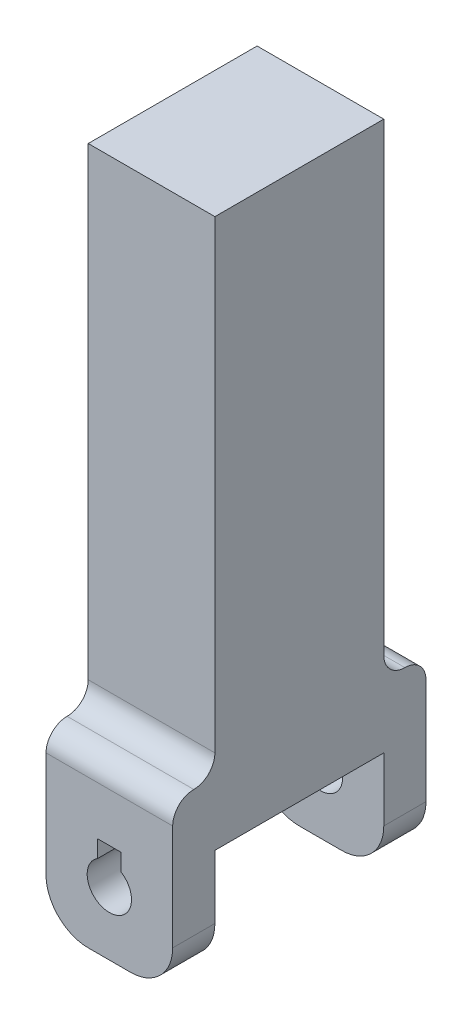
ISO-10303-21;
HEADER;
FILE_DESCRIPTION(('STEP AP214'),'2;1');
FILE_NAME('part.step','',(''),(''),'','','');
FILE_SCHEMA(('AUTOMOTIVE_DESIGN { 1 0 10303 214 1 1 1 1 }'));
ENDSEC;
DATA;
#1=APPLICATION_CONTEXT('core data for automotive mechanical design processes');
#2=APPLICATION_PROTOCOL_DEFINITION('international standard','automotive_design',2000,#1);
#3=PRODUCT_CONTEXT('',#1,'mechanical');
#4=PRODUCT('Part','Part','',(#3));
#5=PRODUCT_RELATED_PRODUCT_CATEGORY('part','',(#4));
#6=PRODUCT_DEFINITION_FORMATION('','',#4);
#7=PRODUCT_DEFINITION_CONTEXT('part definition',#1,'design');
#8=PRODUCT_DEFINITION('design','',#6,#7);
#9=PRODUCT_DEFINITION_SHAPE('','',#8);
#10=(LENGTH_UNIT() NAMED_UNIT(*) SI_UNIT(.MILLI.,.METRE.));
#11=(NAMED_UNIT(*) PLANE_ANGLE_UNIT() SI_UNIT($,.RADIAN.));
#12=(NAMED_UNIT(*) SI_UNIT($,.STERADIAN.) SOLID_ANGLE_UNIT());
#13=UNCERTAINTY_MEASURE_WITH_UNIT(LENGTH_MEASURE(1.E-05),#10,'distance_accuracy_value','');
#14=(GEOMETRIC_REPRESENTATION_CONTEXT(3) GLOBAL_UNCERTAINTY_ASSIGNED_CONTEXT((#13)) GLOBAL_UNIT_ASSIGNED_CONTEXT((#10,
#11,#12)) REPRESENTATION_CONTEXT('',''));
#15=CARTESIAN_POINT('',(0.,0.,0.));
#16=DIRECTION('',(0.,0.,1.));
#17=DIRECTION('',(1.,0.,0.));
#18=AXIS2_PLACEMENT_3D('',#15,#16,#17);
#19=CARTESIAN_POINT('',(-15.,140.,50.));
#20=DIRECTION('',(0.,0.,-1.));
#21=DIRECTION('',(-1.,0.,0.));
#22=AXIS2_PLACEMENT_3D('',#19,#20,#21);
#23=PLANE('',#22);
#24=DIRECTION('',(0.,-1.,0.));
#25=VECTOR('',#24,1.);
#26=CARTESIAN_POINT('',(-15.,140.,50.));
#27=LINE('',#26,#25);
#28=CARTESIAN_POINT('',(-15.,140.,50.));
#29=VERTEX_POINT('',#28);
#30=CARTESIAN_POINT('',(-15.,30.,50.));
#31=VERTEX_POINT('',#30);
#32=EDGE_CURVE('E221',#29,#31,#27,.T.);
#33=ORIENTED_EDGE('',*,*,#32,.T.);
#34=DIRECTION('',(-1.,0.,0.));
#35=VECTOR('',#34,1.);
#36=CARTESIAN_POINT('',(15.,30.,50.));
#37=LINE('',#36,#35);
#38=CARTESIAN_POINT('',(15.,30.,50.));
#39=VERTEX_POINT('',#38);
#40=EDGE_CURVE('E432',#31,#39,#37,.F.);
#41=ORIENTED_EDGE('',*,*,#40,.T.);
#42=DIRECTION('',(0.,-1.,0.));
#43=VECTOR('',#42,1.);
#44=CARTESIAN_POINT('',(15.,140.,50.));
#45=LINE('',#44,#43);
#46=CARTESIAN_POINT('',(15.,140.,50.));
#47=VERTEX_POINT('',#46);
#48=EDGE_CURVE('E223',#47,#39,#45,.T.);
#49=ORIENTED_EDGE('',*,*,#48,.F.);
#50=DIRECTION('',(1.,0.,0.));
#51=VECTOR('',#50,1.);
#52=CARTESIAN_POINT('',(-15.,140.,50.));
#53=LINE('',#52,#51);
#54=EDGE_CURVE('E217',#29,#47,#53,.T.);
#55=ORIENTED_EDGE('',*,*,#54,.F.);
#56=EDGE_LOOP('',(#33,#41,#49,#55));
#57=FACE_BOUND('',#56,.T.);
#58=ADVANCED_FACE('F45',(#57),#23,.F.);
#59=CARTESIAN_POINT('',(0.,0.,60.));
#60=DIRECTION('',(0.,0.,-1.));
#61=DIRECTION('',(-1.,0.,0.));
#62=AXIS2_PLACEMENT_3D('',#59,#60,#61);
#63=CYLINDRICAL_SURFACE('',#62,5.25);
#64=CARTESIAN_POINT('',(0.,0.,50.));
#65=DIRECTION('',(0.,0.,1.));
#66=DIRECTION('',(1.,0.,0.));
#67=AXIS2_PLACEMENT_3D('',#64,#65,#66);
#68=CIRCLE('',#67,5.25);
#69=CARTESIAN_POINT('',(-2.75,4.47213595499958,50.));
#70=VERTEX_POINT('',#69);
#71=CARTESIAN_POINT('',(2.75,4.47213595499958,50.));
#72=VERTEX_POINT('',#71);
#73=EDGE_CURVE('E314',#70,#72,#68,.T.);
#74=ORIENTED_EDGE('',*,*,#73,.F.);
#75=DIRECTION('',(0.,0.,-1.));
#76=VECTOR('',#75,1.);
#77=CARTESIAN_POINT('',(-2.75,4.47213595499958,60.));
#78=LINE('',#77,#76);
#79=CARTESIAN_POINT('',(-2.75,4.47213595499958,60.));
#80=VERTEX_POINT('',#79);
#81=EDGE_CURVE('E384',#80,#70,#78,.T.);
#82=ORIENTED_EDGE('',*,*,#81,.F.);
#83=CARTESIAN_POINT('',(0.,0.,60.));
#84=DIRECTION('',(0.,0.,1.));
#85=DIRECTION('',(1.,0.,0.));
#86=AXIS2_PLACEMENT_3D('',#83,#84,#85);
#87=CIRCLE('',#86,5.25);
#88=CARTESIAN_POINT('',(2.75,4.47213595499958,60.));
#89=VERTEX_POINT('',#88);
#90=EDGE_CURVE('E318',#80,#89,#87,.T.);
#91=ORIENTED_EDGE('',*,*,#90,.T.);
#92=DIRECTION('',(0.,0.,-1.));
#93=VECTOR('',#92,1.);
#94=CARTESIAN_POINT('',(2.75,4.47213595499958,60.));
#95=LINE('',#94,#93);
#96=EDGE_CURVE('E369',#89,#72,#95,.T.);
#97=ORIENTED_EDGE('',*,*,#96,.T.);
#98=EDGE_LOOP('',(#74,#82,#91,#97));
#99=FACE_BOUND('',#98,.T.);
#100=ADVANCED_FACE('F585',(#99),#63,.F.);
#101=CARTESIAN_POINT('',(-2.75,0.,60.));
#102=DIRECTION('',(-1.,0.,0.));
#103=DIRECTION('',(0.,0.,1.));
#104=AXIS2_PLACEMENT_3D('',#101,#102,#103);
#105=PLANE('',#104);
#106=ORIENTED_EDGE('',*,*,#81,.T.);
#107=DIRECTION('',(0.,1.,0.));
#108=VECTOR('',#107,1.);
#109=CARTESIAN_POINT('',(-2.75,0.,50.));
#110=LINE('',#109,#108);
#111=CARTESIAN_POINT('',(-2.75,8.5,50.));
#112=VERTEX_POINT('',#111);
#113=EDGE_CURVE('E310',#70,#112,#110,.T.);
#114=ORIENTED_EDGE('',*,*,#113,.T.);
#115=DIRECTION('',(0.,0.,-1.));
#116=VECTOR('',#115,1.);
#117=CARTESIAN_POINT('',(-2.75,8.5,60.));
#118=LINE('',#117,#116);
#119=CARTESIAN_POINT('',(-2.75,8.5,60.));
#120=VERTEX_POINT('',#119);
#121=EDGE_CURVE('E379',#120,#112,#118,.T.);
#122=ORIENTED_EDGE('',*,*,#121,.F.);
#123=DIRECTION('',(0.,1.,0.));
#124=VECTOR('',#123,1.);
#125=CARTESIAN_POINT('',(-2.75,0.,60.));
#126=LINE('',#125,#124);
#127=EDGE_CURVE('E322',#80,#120,#126,.T.);
#128=ORIENTED_EDGE('',*,*,#127,.F.);
#129=EDGE_LOOP('',(#106,#114,#122,#128));
#130=FACE_BOUND('',#129,.T.);
#131=ADVANCED_FACE('F590',(#130),#105,.F.);
#132=CARTESIAN_POINT('',(0.,8.5,60.));
#133=DIRECTION('',(0.,-1.,0.));
#134=DIRECTION('',(0.,0.,-1.));
#135=AXIS2_PLACEMENT_3D('',#132,#133,#134);
#136=PLANE('',#135);
#137=DIRECTION('',(-1.,0.,0.));
#138=VECTOR('',#137,1.);
#139=CARTESIAN_POINT('',(0.,8.5,50.));
#140=LINE('',#139,#138);
#141=CARTESIAN_POINT('',(2.75,8.5,50.));
#142=VERTEX_POINT('',#141);
#143=EDGE_CURVE('E307',#142,#112,#140,.T.);
#144=ORIENTED_EDGE('',*,*,#143,.F.);
#145=DIRECTION('',(0.,0.,-1.));
#146=VECTOR('',#145,1.);
#147=CARTESIAN_POINT('',(2.75,8.5,60.));
#148=LINE('',#147,#146);
#149=CARTESIAN_POINT('',(2.75,8.5,60.));
#150=VERTEX_POINT('',#149);
#151=EDGE_CURVE('E374',#150,#142,#148,.T.);
#152=ORIENTED_EDGE('',*,*,#151,.F.);
#153=DIRECTION('',(-1.,0.,0.));
#154=VECTOR('',#153,1.);
#155=CARTESIAN_POINT('',(0.,8.5,60.));
#156=LINE('',#155,#154);
#157=EDGE_CURVE('E326',#150,#120,#156,.T.);
#158=ORIENTED_EDGE('',*,*,#157,.T.);
#159=ORIENTED_EDGE('',*,*,#121,.T.);
#160=EDGE_LOOP('',(#144,#152,#158,#159));
#161=FACE_BOUND('',#160,.T.);
#162=ADVANCED_FACE('F615',(#161),#136,.T.);
#163=CARTESIAN_POINT('',(2.75,0.,60.));
#164=DIRECTION('',(-1.,0.,0.));
#165=DIRECTION('',(0.,0.,1.));
#166=AXIS2_PLACEMENT_3D('',#163,#164,#165);
#167=PLANE('',#166);
#168=DIRECTION('',(0.,1.,0.));
#169=VECTOR('',#168,1.);
#170=CARTESIAN_POINT('',(2.75,0.,50.));
#171=LINE('',#170,#169);
#172=EDGE_CURVE('E304',#72,#142,#171,.T.);
#173=ORIENTED_EDGE('',*,*,#172,.F.);
#174=ORIENTED_EDGE('',*,*,#96,.F.);
#175=DIRECTION('',(0.,1.,0.));
#176=VECTOR('',#175,1.);
#177=CARTESIAN_POINT('',(2.75,0.,60.));
#178=LINE('',#177,#176);
#179=EDGE_CURVE('E330',#89,#150,#178,.T.);
#180=ORIENTED_EDGE('',*,*,#179,.T.);
#181=ORIENTED_EDGE('',*,*,#151,.T.);
#182=EDGE_LOOP('',(#173,#174,#180,#181));
#183=FACE_BOUND('',#182,.T.);
#184=ADVANCED_FACE('F612',(#183),#167,.T.);
#185=CARTESIAN_POINT('',(0.,-15.,60.));
#186=DIRECTION('',(0.,1.,0.));
#187=DIRECTION('',(0.,0.,1.));
#188=AXIS2_PLACEMENT_3D('',#185,#186,#187);
#189=PLANE('',#188);
#190=DIRECTION('',(0.,0.,-1.));
#191=VECTOR('',#190,1.);
#192=CARTESIAN_POINT('',(-4.99999999999999,-15.,60.));
#193=LINE('',#192,#191);
#194=CARTESIAN_POINT('',(-4.99999999999999,-15.,60.));
#195=VERTEX_POINT('',#194);
#196=CARTESIAN_POINT('',(-4.99999999999999,-15.,50.));
#197=VERTEX_POINT('',#196);
#198=EDGE_CURVE('E394',#195,#197,#193,.T.);
#199=ORIENTED_EDGE('',*,*,#198,.T.);
#200=DIRECTION('',(-1.,0.,0.));
#201=VECTOR('',#200,1.);
#202=CARTESIAN_POINT('',(15.,-15.,50.));
#203=LINE('',#202,#201);
#204=CARTESIAN_POINT('',(5.00000000000001,-15.,50.));
#205=VERTEX_POINT('',#204);
#206=EDGE_CURVE('E272',#205,#197,#203,.T.);
#207=ORIENTED_EDGE('',*,*,#206,.F.);
#208=DIRECTION('',(0.,0.,-1.));
#209=VECTOR('',#208,1.);
#210=CARTESIAN_POINT('',(5.00000000000001,-15.,60.));
#211=LINE('',#210,#209);
#212=CARTESIAN_POINT('',(5.00000000000001,-15.,60.));
#213=VERTEX_POINT('',#212);
#214=EDGE_CURVE('E388',#205,#213,#211,.F.);
#215=ORIENTED_EDGE('',*,*,#214,.T.);
#216=DIRECTION('',(1.,0.,0.));
#217=VECTOR('',#216,1.);
#218=CARTESIAN_POINT('',(0.,-15.,60.));
#219=LINE('',#218,#217);
#220=EDGE_CURVE('E340',#195,#213,#219,.T.);
#221=ORIENTED_EDGE('',*,*,#220,.F.);
#222=EDGE_LOOP('',(#199,#207,#215,#221));
#223=FACE_BOUND('',#222,.T.);
#224=ADVANCED_FACE('F488',(#223),#189,.F.);
#225=CARTESIAN_POINT('',(-4.99999999999999,-5.,60.));
#226=DIRECTION('',(0.,0.,-1.));
#227=DIRECTION('',(-1.,0.,0.));
#228=AXIS2_PLACEMENT_3D('',#225,#226,#227);
#229=CYLINDRICAL_SURFACE('',#228,10.);
#230=CARTESIAN_POINT('',(-4.99999999999999,-5.,50.));
#231=DIRECTION('',(0.,0.,1.));
#232=DIRECTION('',(1.,0.,0.));
#233=AXIS2_PLACEMENT_3D('',#230,#231,#232);
#234=CIRCLE('',#233,10.);
#235=CARTESIAN_POINT('',(-15.,-5.,50.));
#236=VERTEX_POINT('',#235);
#237=EDGE_CURVE('E301',#197,#236,#234,.F.);
#238=ORIENTED_EDGE('',*,*,#237,.F.);
#239=ORIENTED_EDGE('',*,*,#198,.F.);
#240=CARTESIAN_POINT('',(-4.99999999999999,-5.,60.));
#241=DIRECTION('',(0.,0.,1.));
#242=DIRECTION('',(1.,0.,0.));
#243=AXIS2_PLACEMENT_3D('',#240,#241,#242);
#244=CIRCLE('',#243,10.);
#245=CARTESIAN_POINT('',(-15.,-5.,60.));
#246=VERTEX_POINT('',#245);
#247=EDGE_CURVE('E414',#246,#195,#244,.T.);
#248=ORIENTED_EDGE('',*,*,#247,.F.);
#249=DIRECTION('',(0.,0.,-1.));
#250=VECTOR('',#249,1.);
#251=CARTESIAN_POINT('',(-15.,-5.,60.));
#252=LINE('',#251,#250);
#253=EDGE_CURVE('E405',#236,#246,#252,.F.);
#254=ORIENTED_EDGE('',*,*,#253,.F.);
#255=EDGE_LOOP('',(#238,#239,#248,#254));
#256=FACE_BOUND('',#255,.T.);
#257=ADVANCED_FACE('F484',(#256),#229,.T.);
#258=CARTESIAN_POINT('',(5.00000000000001,-5.,60.));
#259=DIRECTION('',(0.,0.,1.));
#260=DIRECTION('',(1.,0.,0.));
#261=AXIS2_PLACEMENT_3D('',#258,#259,#260);
#262=CYLINDRICAL_SURFACE('',#261,10.);
#263=CARTESIAN_POINT('',(5.00000000000001,-5.,50.));
#264=DIRECTION('',(0.,0.,1.));
#265=DIRECTION('',(1.,0.,0.));
#266=AXIS2_PLACEMENT_3D('',#263,#264,#265);
#267=CIRCLE('',#266,10.);
#268=CARTESIAN_POINT('',(15.,-5.,50.));
#269=VERTEX_POINT('',#268);
#270=EDGE_CURVE('E425',#269,#205,#267,.F.);
#271=ORIENTED_EDGE('',*,*,#270,.F.);
#272=DIRECTION('',(0.,0.,-1.));
#273=VECTOR('',#272,1.);
#274=CARTESIAN_POINT('',(15.,-5.,0.));
#275=LINE('',#274,#273);
#276=CARTESIAN_POINT('',(15.,-5.,60.));
#277=VERTEX_POINT('',#276);
#278=EDGE_CURVE('E418',#277,#269,#275,.T.);
#279=ORIENTED_EDGE('',*,*,#278,.F.);
#280=CARTESIAN_POINT('',(5.00000000000001,-5.,60.));
#281=DIRECTION('',(0.,0.,1.));
#282=DIRECTION('',(1.,0.,0.));
#283=AXIS2_PLACEMENT_3D('',#280,#281,#282);
#284=CIRCLE('',#283,10.);
#285=EDGE_CURVE('E410',#213,#277,#284,.T.);
#286=ORIENTED_EDGE('',*,*,#285,.F.);
#287=ORIENTED_EDGE('',*,*,#214,.F.);
#288=EDGE_LOOP('',(#271,#279,#286,#287));
#289=FACE_BOUND('',#288,.T.);
#290=ADVANCED_FACE('F573',(#289),#262,.T.);
#291=CARTESIAN_POINT('',(15.,0.,60.));
#292=DIRECTION('',(1.,0.,0.));
#293=DIRECTION('',(0.,1.,0.));
#294=AXIS2_PLACEMENT_3D('',#291,#292,#293);
#295=PLANE('',#294);
#296=DIRECTION('',(0.,-1.,0.));
#297=VECTOR('',#296,1.);
#298=CARTESIAN_POINT('',(15.,0.,0.));
#299=LINE('',#298,#297);
#300=CARTESIAN_POINT('',(15.,20.,0.));
#301=VERTEX_POINT('',#300);
#302=CARTESIAN_POINT('',(15.,-5.,0.));
#303=VERTEX_POINT('',#302);
#304=EDGE_CURVE('E360',#301,#303,#299,.T.);
#305=ORIENTED_EDGE('',*,*,#304,.F.);
#306=CARTESIAN_POINT('',(15.,20.,5.));
#307=DIRECTION('',(1.,0.,0.));
#308=DIRECTION('',(0.,1.,0.));
#309=AXIS2_PLACEMENT_3D('',#306,#307,#308);
#310=CIRCLE('',#309,5.);
#311=CARTESIAN_POINT('',(15.,25.,5.));
#312=VERTEX_POINT('',#311);
#313=EDGE_CURVE('E446',#301,#312,#310,.T.);
#314=ORIENTED_EDGE('',*,*,#313,.T.);
#315=CARTESIAN_POINT('',(15.,30.,5.));
#316=DIRECTION('',(1.,0.,0.));
#317=DIRECTION('',(0.,1.,0.));
#318=AXIS2_PLACEMENT_3D('',#315,#316,#317);
#319=CIRCLE('',#318,5.);
#320=CARTESIAN_POINT('',(15.,30.,10.));
#321=VERTEX_POINT('',#320);
#322=EDGE_CURVE('E452',#312,#321,#319,.F.);
#323=ORIENTED_EDGE('',*,*,#322,.T.);
#324=DIRECTION('',(0.,-1.,0.));
#325=VECTOR('',#324,1.);
#326=CARTESIAN_POINT('',(15.,140.,10.));
#327=LINE('',#326,#325);
#328=CARTESIAN_POINT('',(15.,140.,10.));
#329=VERTEX_POINT('',#328);
#330=EDGE_CURVE('E249',#329,#321,#327,.T.);
#331=ORIENTED_EDGE('',*,*,#330,.F.);
#332=DIRECTION('',(0.,0.,-1.));
#333=VECTOR('',#332,1.);
#334=CARTESIAN_POINT('',(15.,140.,10.));
#335=LINE('',#334,#333);
#336=EDGE_CURVE('E227',#47,#329,#335,.T.);
#337=ORIENTED_EDGE('',*,*,#336,.F.);
#338=ORIENTED_EDGE('',*,*,#48,.T.);
#339=CARTESIAN_POINT('',(15.,30.,55.));
#340=DIRECTION('',(1.,0.,0.));
#341=DIRECTION('',(0.,1.,0.));
#342=AXIS2_PLACEMENT_3D('',#339,#340,#341);
#343=CIRCLE('',#342,5.);
#344=CARTESIAN_POINT('',(15.,25.,55.));
#345=VERTEX_POINT('',#344);
#346=EDGE_CURVE('E11',#39,#345,#343,.F.);
#347=ORIENTED_EDGE('',*,*,#346,.T.);
#348=CARTESIAN_POINT('',(15.,20.,55.));
#349=DIRECTION('',(1.,0.,0.));
#350=DIRECTION('',(0.,1.,0.));
#351=AXIS2_PLACEMENT_3D('',#348,#349,#350);
#352=CIRCLE('',#351,5.);
#353=CARTESIAN_POINT('',(15.,20.,60.));
#354=VERTEX_POINT('',#353);
#355=EDGE_CURVE('E62',#345,#354,#352,.T.);
#356=ORIENTED_EDGE('',*,*,#355,.T.);
#357=DIRECTION('',(0.,-1.,0.));
#358=VECTOR('',#357,1.);
#359=CARTESIAN_POINT('',(15.,0.,60.));
#360=LINE('',#359,#358);
#361=EDGE_CURVE('E334',#354,#277,#360,.T.);
#362=ORIENTED_EDGE('',*,*,#361,.T.);
#363=ORIENTED_EDGE('',*,*,#278,.T.);
#364=DIRECTION('',(0.,1.,0.));
#365=VECTOR('',#364,1.);
#366=CARTESIAN_POINT('',(15.,10.,50.));
#367=LINE('',#366,#365);
#368=CARTESIAN_POINT('',(15.,10.,50.));
#369=VERTEX_POINT('',#368);
#370=EDGE_CURVE('E253',#269,#369,#367,.T.);
#371=ORIENTED_EDGE('',*,*,#370,.T.);
#372=DIRECTION('',(0.,0.,-1.));
#373=VECTOR('',#372,1.);
#374=CARTESIAN_POINT('',(15.,10.,10.));
#375=LINE('',#374,#373);
#376=CARTESIAN_POINT('',(15.,10.,10.));
#377=VERTEX_POINT('',#376);
#378=EDGE_CURVE('E257',#369,#377,#375,.T.);
#379=ORIENTED_EDGE('',*,*,#378,.T.);
#380=DIRECTION('',(0.,-1.,0.));
#381=VECTOR('',#380,1.);
#382=CARTESIAN_POINT('',(15.,10.,10.));
#383=LINE('',#382,#381);
#384=CARTESIAN_POINT('',(15.,-5.,10.));
#385=VERTEX_POINT('',#384);
#386=EDGE_CURVE('E262',#377,#385,#383,.T.);
#387=ORIENTED_EDGE('',*,*,#386,.T.);
#388=EDGE_CURVE('E417',#385,#303,#275,.T.);
#389=ORIENTED_EDGE('',*,*,#388,.T.);
#390=EDGE_LOOP('',(#305,#314,#323,#331,#337,#338,#347,#356,#362,#363,#371,#379,#387,#389));
#391=FACE_BOUND('',#390,.T.);
#392=ADVANCED_FACE('F545',(#391),#295,.T.);
#393=CARTESIAN_POINT('',(-15.,0.,60.));
#394=DIRECTION('',(1.,0.,0.));
#395=DIRECTION('',(0.,1.,0.));
#396=AXIS2_PLACEMENT_3D('',#393,#394,#395);
#397=PLANE('',#396);
#398=DIRECTION('',(0.,-1.,0.));
#399=VECTOR('',#398,1.);
#400=CARTESIAN_POINT('',(-15.,140.,10.));
#401=LINE('',#400,#399);
#402=CARTESIAN_POINT('',(-15.,140.,10.));
#403=VERTEX_POINT('',#402);
#404=CARTESIAN_POINT('',(-15.,30.,10.));
#405=VERTEX_POINT('',#404);
#406=EDGE_CURVE('E561',#403,#405,#401,.T.);
#407=ORIENTED_EDGE('',*,*,#406,.T.);
#408=CARTESIAN_POINT('',(-15.,30.,5.));
#409=DIRECTION('',(1.,0.,0.));
#410=DIRECTION('',(0.,1.,0.));
#411=AXIS2_PLACEMENT_3D('',#408,#409,#410);
#412=CIRCLE('',#411,5.);
#413=CARTESIAN_POINT('',(-15.,25.,5.));
#414=VERTEX_POINT('',#413);
#415=EDGE_CURVE('E455',#405,#414,#412,.T.);
#416=ORIENTED_EDGE('',*,*,#415,.T.);
#417=CARTESIAN_POINT('',(-15.,20.,5.));
#418=DIRECTION('',(1.,0.,0.));
#419=DIRECTION('',(0.,1.,0.));
#420=AXIS2_PLACEMENT_3D('',#417,#418,#419);
#421=CIRCLE('',#420,5.);
#422=CARTESIAN_POINT('',(-15.,20.,0.));
#423=VERTEX_POINT('',#422);
#424=EDGE_CURVE('E438',#414,#423,#421,.F.);
#425=ORIENTED_EDGE('',*,*,#424,.T.);
#426=DIRECTION('',(0.,-1.,0.));
#427=VECTOR('',#426,1.);
#428=CARTESIAN_POINT('',(-15.,0.,0.));
#429=LINE('',#428,#427);
#430=CARTESIAN_POINT('',(-15.,-5.,0.));
#431=VERTEX_POINT('',#430);
#432=EDGE_CURVE('E363',#423,#431,#429,.T.);
#433=ORIENTED_EDGE('',*,*,#432,.T.);
#434=CARTESIAN_POINT('',(-15.,-5.,10.));
#435=VERTEX_POINT('',#434);
#436=EDGE_CURVE('E406',#431,#435,#252,.F.);
#437=ORIENTED_EDGE('',*,*,#436,.T.);
#438=DIRECTION('',(0.,-1.,0.));
#439=VECTOR('',#438,1.);
#440=CARTESIAN_POINT('',(-15.,10.,10.));
#441=LINE('',#440,#439);
#442=CARTESIAN_POINT('',(-15.,10.,10.));
#443=VERTEX_POINT('',#442);
#444=EDGE_CURVE('E258',#443,#435,#441,.T.);
#445=ORIENTED_EDGE('',*,*,#444,.F.);
#446=DIRECTION('',(0.,0.,-1.));
#447=VECTOR('',#446,1.);
#448=CARTESIAN_POINT('',(-15.,10.,10.));
#449=LINE('',#448,#447);
#450=CARTESIAN_POINT('',(-15.,10.,50.));
#451=VERTEX_POINT('',#450);
#452=EDGE_CURVE('E247',#451,#443,#449,.T.);
#453=ORIENTED_EDGE('',*,*,#452,.F.);
#454=DIRECTION('',(0.,1.,0.));
#455=VECTOR('',#454,1.);
#456=CARTESIAN_POINT('',(-15.,10.,50.));
#457=LINE('',#456,#455);
#458=EDGE_CURVE('E243',#236,#451,#457,.T.);
#459=ORIENTED_EDGE('',*,*,#458,.F.);
#460=ORIENTED_EDGE('',*,*,#253,.T.);
#461=DIRECTION('',(0.,-1.,0.));
#462=VECTOR('',#461,1.);
#463=CARTESIAN_POINT('',(-15.,0.,60.));
#464=LINE('',#463,#462);
#465=CARTESIAN_POINT('',(-15.,20.,60.));
#466=VERTEX_POINT('',#465);
#467=EDGE_CURVE('E337',#466,#246,#464,.T.);
#468=ORIENTED_EDGE('',*,*,#467,.F.);
#469=CARTESIAN_POINT('',(-15.,20.,55.));
#470=DIRECTION('',(1.,0.,0.));
#471=DIRECTION('',(0.,1.,0.));
#472=AXIS2_PLACEMENT_3D('',#469,#470,#471);
#473=CIRCLE('',#472,5.);
#474=CARTESIAN_POINT('',(-15.,25.,55.));
#475=VERTEX_POINT('',#474);
#476=EDGE_CURVE('E435',#466,#475,#473,.F.);
#477=ORIENTED_EDGE('',*,*,#476,.T.);
#478=CARTESIAN_POINT('',(-15.,30.,55.));
#479=DIRECTION('',(1.,0.,0.));
#480=DIRECTION('',(0.,1.,0.));
#481=AXIS2_PLACEMENT_3D('',#478,#479,#480);
#482=CIRCLE('',#481,5.);
#483=EDGE_CURVE('E55',#475,#31,#482,.T.);
#484=ORIENTED_EDGE('',*,*,#483,.T.);
#485=ORIENTED_EDGE('',*,*,#32,.F.);
#486=DIRECTION('',(0.,0.,1.));
#487=VECTOR('',#486,1.);
#488=CARTESIAN_POINT('',(-15.,140.,10.));
#489=LINE('',#488,#487);
#490=EDGE_CURVE('E228',#403,#29,#489,.T.);
#491=ORIENTED_EDGE('',*,*,#490,.F.);
#492=EDGE_LOOP('',(#407,#416,#425,#433,#437,#445,#453,#459,#460,#468,#477,#484,#485,#491));
#493=FACE_BOUND('',#492,.T.);
#494=ADVANCED_FACE('F240',(#493),#397,.F.);
#495=CARTESIAN_POINT('',(0.,0.,10.));
#496=DIRECTION('',(0.,0.,-1.));
#497=DIRECTION('',(0.,1.,0.));
#498=AXIS2_PLACEMENT_3D('',#495,#496,#497);
#499=CIRCLE('',#498,5.25);
#500=CARTESIAN_POINT('',(2.75,4.47213595499958,10.));
#501=VERTEX_POINT('',#500);
#502=CARTESIAN_POINT('',(-2.75,4.47213595499958,10.));
#503=VERTEX_POINT('',#502);
#504=EDGE_CURVE('E298',#501,#503,#499,.T.);
#505=ORIENTED_EDGE('',*,*,#504,.F.);
#506=CARTESIAN_POINT('',(2.75,4.47213595499958,0.));
#507=VERTEX_POINT('',#506);
#508=EDGE_CURVE('E344',#501,#507,#95,.T.);
#509=ORIENTED_EDGE('',*,*,#508,.T.);
#510=CARTESIAN_POINT('',(0.,0.,0.));
#511=DIRECTION('',(0.,0.,1.));
#512=DIRECTION('',(1.,0.,0.));
#513=AXIS2_PLACEMENT_3D('',#510,#511,#512);
#514=CIRCLE('',#513,5.25);
#515=CARTESIAN_POINT('',(-2.75,4.47213595499958,0.));
#516=VERTEX_POINT('',#515);
#517=EDGE_CURVE('E317',#516,#507,#514,.T.);
#518=ORIENTED_EDGE('',*,*,#517,.F.);
#519=EDGE_CURVE('E383',#503,#516,#78,.T.);
#520=ORIENTED_EDGE('',*,*,#519,.F.);
#521=EDGE_LOOP('',(#505,#509,#518,#520));
#522=FACE_BOUND('',#521,.T.);
#523=ADVANCED_FACE('F503',(#522),#63,.F.);
#524=CARTESIAN_POINT('',(-2.75,8.5,10.));
#525=VERTEX_POINT('',#524);
#526=CARTESIAN_POINT('',(-2.75,8.5,0.));
#527=VERTEX_POINT('',#526);
#528=EDGE_CURVE('E378',#525,#527,#118,.T.);
#529=ORIENTED_EDGE('',*,*,#528,.F.);
#530=DIRECTION('',(0.,-1.,0.));
#531=VECTOR('',#530,1.);
#532=CARTESIAN_POINT('',(-2.75,0.,10.));
#533=LINE('',#532,#531);
#534=EDGE_CURVE('E294',#525,#503,#533,.T.);
#535=ORIENTED_EDGE('',*,*,#534,.T.);
#536=ORIENTED_EDGE('',*,*,#519,.T.);
#537=DIRECTION('',(0.,1.,0.));
#538=VECTOR('',#537,1.);
#539=CARTESIAN_POINT('',(-2.75,0.,0.));
#540=LINE('',#539,#538);
#541=EDGE_CURVE('E348',#516,#527,#540,.T.);
#542=ORIENTED_EDGE('',*,*,#541,.T.);
#543=EDGE_LOOP('',(#529,#535,#536,#542));
#544=FACE_BOUND('',#543,.T.);
#545=ADVANCED_FACE('F520',(#544),#105,.F.);
#546=DIRECTION('',(1.,0.,0.));
#547=VECTOR('',#546,1.);
#548=CARTESIAN_POINT('',(0.,8.5,10.));
#549=LINE('',#548,#547);
#550=CARTESIAN_POINT('',(2.75,8.5,10.));
#551=VERTEX_POINT('',#550);
#552=EDGE_CURVE('E291',#525,#551,#549,.T.);
#553=ORIENTED_EDGE('',*,*,#552,.F.);
#554=ORIENTED_EDGE('',*,*,#528,.T.);
#555=DIRECTION('',(-1.,0.,0.));
#556=VECTOR('',#555,1.);
#557=CARTESIAN_POINT('',(0.,8.5,0.));
#558=LINE('',#557,#556);
#559=CARTESIAN_POINT('',(2.75,8.5,0.));
#560=VERTEX_POINT('',#559);
#561=EDGE_CURVE('E352',#560,#527,#558,.T.);
#562=ORIENTED_EDGE('',*,*,#561,.F.);
#563=EDGE_CURVE('E373',#551,#560,#148,.T.);
#564=ORIENTED_EDGE('',*,*,#563,.F.);
#565=EDGE_LOOP('',(#553,#554,#562,#564));
#566=FACE_BOUND('',#565,.T.);
#567=ADVANCED_FACE('F517',(#566),#136,.T.);
#568=DIRECTION('',(0.,-1.,0.));
#569=VECTOR('',#568,1.);
#570=CARTESIAN_POINT('',(2.75,0.,10.));
#571=LINE('',#570,#569);
#572=EDGE_CURVE('E288',#551,#501,#571,.T.);
#573=ORIENTED_EDGE('',*,*,#572,.F.);
#574=ORIENTED_EDGE('',*,*,#563,.T.);
#575=DIRECTION('',(0.,1.,0.));
#576=VECTOR('',#575,1.);
#577=CARTESIAN_POINT('',(2.75,0.,0.));
#578=LINE('',#577,#576);
#579=EDGE_CURVE('E356',#507,#560,#578,.T.);
#580=ORIENTED_EDGE('',*,*,#579,.F.);
#581=ORIENTED_EDGE('',*,*,#508,.F.);
#582=EDGE_LOOP('',(#573,#574,#580,#581));
#583=FACE_BOUND('',#582,.T.);
#584=ADVANCED_FACE('F512',(#583),#167,.T.);
#585=CARTESIAN_POINT('',(5.00000000000001,-15.,0.));
#586=VERTEX_POINT('',#585);
#587=CARTESIAN_POINT('',(5.00000000000001,-15.,10.));
#588=VERTEX_POINT('',#587);
#589=EDGE_CURVE('E389',#586,#588,#211,.F.);
#590=ORIENTED_EDGE('',*,*,#589,.T.);
#591=DIRECTION('',(-1.,0.,0.));
#592=VECTOR('',#591,1.);
#593=CARTESIAN_POINT('',(15.,-15.,10.));
#594=LINE('',#593,#592);
#595=CARTESIAN_POINT('',(-4.99999999999999,-15.,10.));
#596=VERTEX_POINT('',#595);
#597=EDGE_CURVE('E276',#588,#596,#594,.T.);
#598=ORIENTED_EDGE('',*,*,#597,.T.);
#599=CARTESIAN_POINT('',(-4.99999999999999,-15.,0.));
#600=VERTEX_POINT('',#599);
#601=EDGE_CURVE('E393',#596,#600,#193,.T.);
#602=ORIENTED_EDGE('',*,*,#601,.T.);
#603=DIRECTION('',(1.,0.,0.));
#604=VECTOR('',#603,1.);
#605=CARTESIAN_POINT('',(0.,-15.,0.));
#606=LINE('',#605,#604);
#607=EDGE_CURVE('E323',#600,#586,#606,.T.);
#608=ORIENTED_EDGE('',*,*,#607,.T.);
#609=EDGE_LOOP('',(#590,#598,#602,#608));
#610=FACE_BOUND('',#609,.T.);
#611=ADVANCED_FACE('F535',(#610),#189,.F.);
#612=CARTESIAN_POINT('',(0.,0.,60.));
#613=DIRECTION('',(0.,0.,1.));
#614=DIRECTION('',(1.,0.,0.));
#615=AXIS2_PLACEMENT_3D('',#612,#613,#614);
#616=PLANE('',#615);
#617=ORIENTED_EDGE('',*,*,#90,.F.);
#618=ORIENTED_EDGE('',*,*,#127,.T.);
#619=ORIENTED_EDGE('',*,*,#157,.F.);
#620=ORIENTED_EDGE('',*,*,#179,.F.);
#621=EDGE_LOOP('',(#617,#618,#619,#620));
#622=FACE_BOUND('',#621,.T.);
#623=ORIENTED_EDGE('',*,*,#361,.F.);
#624=DIRECTION('',(1.,0.,0.));
#625=VECTOR('',#624,1.);
#626=CARTESIAN_POINT('',(-15.,20.,60.));
#627=LINE('',#626,#625);
#628=EDGE_CURVE('E449',#354,#466,#627,.F.);
#629=ORIENTED_EDGE('',*,*,#628,.T.);
#630=ORIENTED_EDGE('',*,*,#467,.T.);
#631=ORIENTED_EDGE('',*,*,#247,.T.);
#632=ORIENTED_EDGE('',*,*,#220,.T.);
#633=ORIENTED_EDGE('',*,*,#285,.T.);
#634=EDGE_LOOP('',(#623,#629,#630,#631,#632,#633));
#635=FACE_BOUND('',#634,.T.);
#636=ADVANCED_FACE('F474',(#622,#635),#616,.T.);
#637=CARTESIAN_POINT('',(0.,0.,0.));
#638=DIRECTION('',(0.,0.,1.));
#639=DIRECTION('',(1.,0.,0.));
#640=AXIS2_PLACEMENT_3D('',#637,#638,#639);
#641=PLANE('',#640);
#642=ORIENTED_EDGE('',*,*,#517,.T.);
#643=ORIENTED_EDGE('',*,*,#579,.T.);
#644=ORIENTED_EDGE('',*,*,#561,.T.);
#645=ORIENTED_EDGE('',*,*,#541,.F.);
#646=EDGE_LOOP('',(#642,#643,#644,#645));
#647=FACE_BOUND('',#646,.T.);
#648=ORIENTED_EDGE('',*,*,#432,.F.);
#649=DIRECTION('',(-1.,0.,0.));
#650=VECTOR('',#649,1.);
#651=CARTESIAN_POINT('',(15.,20.,0.));
#652=LINE('',#651,#650);
#653=EDGE_CURVE('E441',#423,#301,#652,.F.);
#654=ORIENTED_EDGE('',*,*,#653,.T.);
#655=ORIENTED_EDGE('',*,*,#304,.T.);
#656=CARTESIAN_POINT('',(5.00000000000001,-5.,0.));
#657=DIRECTION('',(0.,0.,1.));
#658=DIRECTION('',(1.,0.,0.));
#659=AXIS2_PLACEMENT_3D('',#656,#657,#658);
#660=CIRCLE('',#659,10.);
#661=EDGE_CURVE('E398',#303,#586,#660,.F.);
#662=ORIENTED_EDGE('',*,*,#661,.T.);
#663=ORIENTED_EDGE('',*,*,#607,.F.);
#664=CARTESIAN_POINT('',(-4.99999999999999,-5.,0.));
#665=DIRECTION('',(0.,0.,1.));
#666=DIRECTION('',(1.,0.,0.));
#667=AXIS2_PLACEMENT_3D('',#664,#665,#666);
#668=CIRCLE('',#667,10.);
#669=EDGE_CURVE('E401',#600,#431,#668,.F.);
#670=ORIENTED_EDGE('',*,*,#669,.T.);
#671=EDGE_LOOP('',(#648,#654,#655,#662,#663,#670));
#672=FACE_BOUND('',#671,.T.);
#673=ADVANCED_FACE('F510',(#647,#672),#641,.F.);
#674=CARTESIAN_POINT('',(-4.99999999999999,-5.,10.));
#675=DIRECTION('',(0.,0.,-1.));
#676=DIRECTION('',(0.,1.,0.));
#677=AXIS2_PLACEMENT_3D('',#674,#675,#676);
#678=CIRCLE('',#677,10.);
#679=EDGE_CURVE('E275',#435,#596,#678,.F.);
#680=ORIENTED_EDGE('',*,*,#679,.F.);
#681=ORIENTED_EDGE('',*,*,#436,.F.);
#682=ORIENTED_EDGE('',*,*,#669,.F.);
#683=ORIENTED_EDGE('',*,*,#601,.F.);
#684=EDGE_LOOP('',(#680,#681,#682,#683));
#685=FACE_BOUND('',#684,.T.);
#686=ADVANCED_FACE('F538',(#685),#229,.T.);
#687=CARTESIAN_POINT('',(5.00000000000001,-5.,10.));
#688=DIRECTION('',(0.,0.,-1.));
#689=DIRECTION('',(0.,1.,0.));
#690=AXIS2_PLACEMENT_3D('',#687,#688,#689);
#691=CIRCLE('',#690,10.);
#692=EDGE_CURVE('E422',#588,#385,#691,.F.);
#693=ORIENTED_EDGE('',*,*,#692,.F.);
#694=ORIENTED_EDGE('',*,*,#589,.F.);
#695=ORIENTED_EDGE('',*,*,#661,.F.);
#696=ORIENTED_EDGE('',*,*,#388,.F.);
#697=EDGE_LOOP('',(#693,#694,#695,#696));
#698=FACE_BOUND('',#697,.T.);
#699=ADVANCED_FACE('F549',(#698),#262,.T.);
#700=CARTESIAN_POINT('',(15.,10.,50.));
#701=DIRECTION('',(0.,0.,1.));
#702=DIRECTION('',(1.,0.,0.));
#703=AXIS2_PLACEMENT_3D('',#700,#701,#702);
#704=PLANE('',#703);
#705=ORIENTED_EDGE('',*,*,#73,.T.);
#706=ORIENTED_EDGE('',*,*,#172,.T.);
#707=ORIENTED_EDGE('',*,*,#143,.T.);
#708=ORIENTED_EDGE('',*,*,#113,.F.);
#709=EDGE_LOOP('',(#705,#706,#707,#708));
#710=FACE_BOUND('',#709,.T.);
#711=ORIENTED_EDGE('',*,*,#237,.T.);
#712=ORIENTED_EDGE('',*,*,#458,.T.);
#713=DIRECTION('',(-1.,0.,0.));
#714=VECTOR('',#713,1.);
#715=CARTESIAN_POINT('',(15.,10.,50.));
#716=LINE('',#715,#714);
#717=EDGE_CURVE('E265',#369,#451,#716,.T.);
#718=ORIENTED_EDGE('',*,*,#717,.F.);
#719=ORIENTED_EDGE('',*,*,#370,.F.);
#720=ORIENTED_EDGE('',*,*,#270,.T.);
#721=ORIENTED_EDGE('',*,*,#206,.T.);
#722=EDGE_LOOP('',(#711,#712,#718,#719,#720,#721));
#723=FACE_BOUND('',#722,.T.);
#724=ADVANCED_FACE('F526',(#710,#723),#704,.F.);
#725=CARTESIAN_POINT('',(15.,10.,10.));
#726=DIRECTION('',(0.,0.,-1.));
#727=DIRECTION('',(0.,1.,0.));
#728=AXIS2_PLACEMENT_3D('',#725,#726,#727);
#729=PLANE('',#728);
#730=ORIENTED_EDGE('',*,*,#504,.T.);
#731=ORIENTED_EDGE('',*,*,#534,.F.);
#732=ORIENTED_EDGE('',*,*,#552,.T.);
#733=ORIENTED_EDGE('',*,*,#572,.T.);
#734=EDGE_LOOP('',(#730,#731,#732,#733));
#735=FACE_BOUND('',#734,.T.);
#736=ORIENTED_EDGE('',*,*,#679,.T.);
#737=ORIENTED_EDGE('',*,*,#597,.F.);
#738=ORIENTED_EDGE('',*,*,#692,.T.);
#739=ORIENTED_EDGE('',*,*,#386,.F.);
#740=DIRECTION('',(-1.,0.,0.));
#741=VECTOR('',#740,1.);
#742=CARTESIAN_POINT('',(15.,10.,10.));
#743=LINE('',#742,#741);
#744=EDGE_CURVE('E280',#377,#443,#743,.T.);
#745=ORIENTED_EDGE('',*,*,#744,.T.);
#746=ORIENTED_EDGE('',*,*,#444,.T.);
#747=EDGE_LOOP('',(#736,#737,#738,#739,#745,#746));
#748=FACE_BOUND('',#747,.T.);
#749=ADVANCED_FACE('F522',(#735,#748),#729,.F.);
#750=CARTESIAN_POINT('',(15.,10.,10.));
#751=DIRECTION('',(0.,1.,0.));
#752=DIRECTION('',(-1.,0.,0.));
#753=AXIS2_PLACEMENT_3D('',#750,#751,#752);
#754=PLANE('',#753);
#755=ORIENTED_EDGE('',*,*,#452,.T.);
#756=ORIENTED_EDGE('',*,*,#744,.F.);
#757=ORIENTED_EDGE('',*,*,#378,.F.);
#758=ORIENTED_EDGE('',*,*,#717,.T.);
#759=EDGE_LOOP('',(#755,#756,#757,#758));
#760=FACE_BOUND('',#759,.T.);
#761=ADVANCED_FACE('F525',(#760),#754,.F.);
#762=CARTESIAN_POINT('',(-15.,140.,10.));
#763=DIRECTION('',(0.,0.,1.));
#764=DIRECTION('',(1.,0.,0.));
#765=AXIS2_PLACEMENT_3D('',#762,#763,#764);
#766=PLANE('',#765);
#767=ORIENTED_EDGE('',*,*,#330,.T.);
#768=DIRECTION('',(1.,0.,0.));
#769=VECTOR('',#768,1.);
#770=CARTESIAN_POINT('',(-15.,30.,10.));
#771=LINE('',#770,#769);
#772=EDGE_CURVE('E428',#321,#405,#771,.F.);
#773=ORIENTED_EDGE('',*,*,#772,.T.);
#774=ORIENTED_EDGE('',*,*,#406,.F.);
#775=DIRECTION('',(-1.,0.,0.));
#776=VECTOR('',#775,1.);
#777=CARTESIAN_POINT('',(-15.,140.,10.));
#778=LINE('',#777,#776);
#779=EDGE_CURVE('E233',#329,#403,#778,.T.);
#780=ORIENTED_EDGE('',*,*,#779,.F.);
#781=EDGE_LOOP('',(#767,#773,#774,#780));
#782=FACE_BOUND('',#781,.T.);
#783=ADVANCED_FACE('F559',(#782),#766,.F.);
#784=CARTESIAN_POINT('',(0.,140.,0.));
#785=DIRECTION('',(0.,1.,0.));
#786=DIRECTION('',(0.,0.,1.));
#787=AXIS2_PLACEMENT_3D('',#784,#785,#786);
#788=PLANE('',#787);
#789=ORIENTED_EDGE('',*,*,#490,.T.);
#790=ORIENTED_EDGE('',*,*,#54,.T.);
#791=ORIENTED_EDGE('',*,*,#336,.T.);
#792=ORIENTED_EDGE('',*,*,#779,.T.);
#793=EDGE_LOOP('',(#789,#790,#791,#792));
#794=FACE_BOUND('',#793,.T.);
#795=ADVANCED_FACE('F231',(#794),#788,.T.);
#796=CARTESIAN_POINT('',(0.,20.,5.));
#797=DIRECTION('',(1.,0.,0.));
#798=DIRECTION('',(0.,0.,-1.));
#799=AXIS2_PLACEMENT_3D('',#796,#797,#798);
#800=CYLINDRICAL_SURFACE('',#799,5.);
#801=ORIENTED_EDGE('',*,*,#653,.F.);
#802=ORIENTED_EDGE('',*,*,#424,.F.);
#803=DIRECTION('',(-1.,0.,0.));
#804=VECTOR('',#803,1.);
#805=CARTESIAN_POINT('',(-15.,25.,5.));
#806=LINE('',#805,#804);
#807=EDGE_CURVE('E238',#312,#414,#806,.T.);
#808=ORIENTED_EDGE('',*,*,#807,.F.);
#809=ORIENTED_EDGE('',*,*,#313,.F.);
#810=EDGE_LOOP('',(#801,#802,#808,#809));
#811=FACE_BOUND('',#810,.T.);
#812=ADVANCED_FACE('F554',(#811),#800,.T.);
#813=CARTESIAN_POINT('',(0.,30.,5.));
#814=DIRECTION('',(1.,0.,0.));
#815=DIRECTION('',(0.,0.,-1.));
#816=AXIS2_PLACEMENT_3D('',#813,#814,#815);
#817=CYLINDRICAL_SURFACE('',#816,5.);
#818=ORIENTED_EDGE('',*,*,#415,.F.);
#819=ORIENTED_EDGE('',*,*,#772,.F.);
#820=ORIENTED_EDGE('',*,*,#322,.F.);
#821=ORIENTED_EDGE('',*,*,#807,.T.);
#822=EDGE_LOOP('',(#818,#819,#820,#821));
#823=FACE_BOUND('',#822,.T.);
#824=ADVANCED_FACE('F562',(#823),#817,.F.);
#825=CARTESIAN_POINT('',(0.,20.,55.));
#826=DIRECTION('',(-1.,0.,0.));
#827=DIRECTION('',(0.,0.,1.));
#828=AXIS2_PLACEMENT_3D('',#825,#826,#827);
#829=CYLINDRICAL_SURFACE('',#828,5.);
#830=ORIENTED_EDGE('',*,*,#628,.F.);
#831=ORIENTED_EDGE('',*,*,#355,.F.);
#832=DIRECTION('',(1.,0.,0.));
#833=VECTOR('',#832,1.);
#834=CARTESIAN_POINT('',(15.,25.,55.));
#835=LINE('',#834,#833);
#836=EDGE_CURVE('E49',#475,#345,#835,.T.);
#837=ORIENTED_EDGE('',*,*,#836,.F.);
#838=ORIENTED_EDGE('',*,*,#476,.F.);
#839=EDGE_LOOP('',(#830,#831,#837,#838));
#840=FACE_BOUND('',#839,.T.);
#841=ADVANCED_FACE('F47',(#840),#829,.T.);
#842=CARTESIAN_POINT('',(0.,30.,55.));
#843=DIRECTION('',(1.,0.,0.));
#844=DIRECTION('',(0.,0.,-1.));
#845=AXIS2_PLACEMENT_3D('',#842,#843,#844);
#846=CYLINDRICAL_SURFACE('',#845,5.);
#847=ORIENTED_EDGE('',*,*,#346,.F.);
#848=ORIENTED_EDGE('',*,*,#40,.F.);
#849=ORIENTED_EDGE('',*,*,#483,.F.);
#850=ORIENTED_EDGE('',*,*,#836,.T.);
#851=EDGE_LOOP('',(#847,#848,#849,#850));
#852=FACE_BOUND('',#851,.T.);
#853=ADVANCED_FACE('F468',(#852),#846,.F.);
#854=CLOSED_SHELL('',(#58,#100,#131,#162,#184,#224,#257,#290,#392,#494,#523,#545,#567,#584,#611,
#636,#673,#686,#699,#724,#749,#761,#783,#795,#812,#824,#841,#853));
#855=MANIFOLD_SOLID_BREP('B2',#854);
#856=ADVANCED_BREP_SHAPE_REPRESENTATION('',(#18,#855),#14);
#857=SHAPE_DEFINITION_REPRESENTATION(#9,#856);
ENDSEC;
END-ISO-10303-21;
